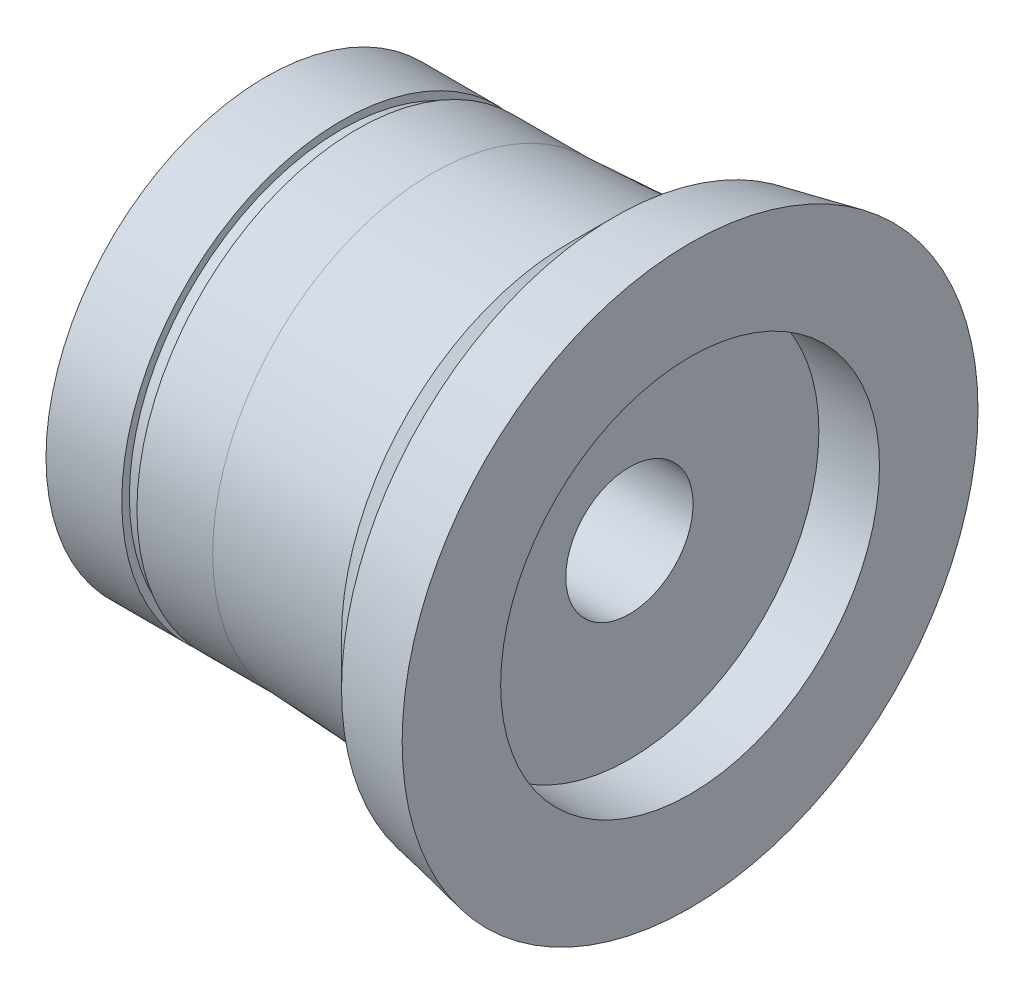
ISO-10303-21;
HEADER;
FILE_DESCRIPTION(('STEP AP214'),'2;1');
FILE_NAME('part.step','',(''),(''),'','','');
FILE_SCHEMA(('AUTOMOTIVE_DESIGN { 1 0 10303 214 1 1 1 1 }'));
ENDSEC;
DATA;
#1=APPLICATION_CONTEXT('core data for automotive mechanical design processes');
#2=APPLICATION_PROTOCOL_DEFINITION('international standard','automotive_design',2000,#1);
#3=PRODUCT_CONTEXT('',#1,'mechanical');
#4=PRODUCT('Part','Part','',(#3));
#5=PRODUCT_RELATED_PRODUCT_CATEGORY('part','',(#4));
#6=PRODUCT_DEFINITION_FORMATION('','',#4);
#7=PRODUCT_DEFINITION_CONTEXT('part definition',#1,'design');
#8=PRODUCT_DEFINITION('design','',#6,#7);
#9=PRODUCT_DEFINITION_SHAPE('','',#8);
#10=(LENGTH_UNIT() NAMED_UNIT(*) SI_UNIT(.MILLI.,.METRE.));
#11=(NAMED_UNIT(*) PLANE_ANGLE_UNIT() SI_UNIT($,.RADIAN.));
#12=(NAMED_UNIT(*) SI_UNIT($,.STERADIAN.) SOLID_ANGLE_UNIT());
#13=UNCERTAINTY_MEASURE_WITH_UNIT(LENGTH_MEASURE(1.E-05),#10,'distance_accuracy_value','');
#14=(GEOMETRIC_REPRESENTATION_CONTEXT(3) GLOBAL_UNCERTAINTY_ASSIGNED_CONTEXT((#13)) GLOBAL_UNIT_ASSIGNED_CONTEXT((#10,
#11,#12)) REPRESENTATION_CONTEXT('',''));
#15=CARTESIAN_POINT('',(0.,0.,0.));
#16=DIRECTION('',(0.,0.,1.));
#17=DIRECTION('',(1.,0.,0.));
#18=AXIS2_PLACEMENT_3D('',#15,#16,#17);
#19=CARTESIAN_POINT('',(0.,0.,0.));
#20=DIRECTION('',(1.,0.,0.));
#21=DIRECTION('',(0.,0.,-1.));
#22=AXIS2_PLACEMENT_3D('',#19,#20,#21);
#23=CONICAL_SURFACE('',#22,9.5,0.197395559849881);
#24=CARTESIAN_POINT('',(-2.5,0.,0.));
#25=DIRECTION('',(-1.,0.,0.));
#26=DIRECTION('',(0.,0.,1.));
#27=AXIS2_PLACEMENT_3D('',#24,#25,#26);
#28=CIRCLE('',#27,9.);
#29=CARTESIAN_POINT('',(-2.5,0.,9.));
#30=VERTEX_POINT('',#29);
#31=EDGE_CURVE('E73',#30,#30,#28,.T.);
#32=ORIENTED_EDGE('',*,*,#31,.F.);
#33=EDGE_LOOP('',(#32));
#34=FACE_BOUND('',#33,.T.);
#35=CARTESIAN_POINT('',(0.,0.,0.));
#36=DIRECTION('',(-1.,0.,0.));
#37=DIRECTION('',(0.,0.,1.));
#38=AXIS2_PLACEMENT_3D('',#35,#36,#37);
#39=CIRCLE('',#38,9.5);
#40=CARTESIAN_POINT('',(0.,0.,9.5));
#41=VERTEX_POINT('',#40);
#42=EDGE_CURVE('E10',#41,#41,#39,.T.);
#43=ORIENTED_EDGE('',*,*,#42,.T.);
#44=EDGE_LOOP('',(#43));
#45=FACE_BOUND('',#44,.T.);
#46=ADVANCED_FACE('F24',(#34,#45),#23,.T.);
#47=CARTESIAN_POINT('',(0.,9.5,0.));
#48=DIRECTION('',(-1.,0.,0.));
#49=DIRECTION('',(0.,0.,1.));
#50=AXIS2_PLACEMENT_3D('',#47,#48,#49);
#51=PLANE('',#50);
#52=ORIENTED_EDGE('',*,*,#42,.F.);
#53=EDGE_LOOP('',(#52));
#54=FACE_BOUND('',#53,.T.);
#55=CARTESIAN_POINT('',(0.,0.,0.));
#56=DIRECTION('',(-1.,0.,0.));
#57=DIRECTION('',(0.,0.,1.));
#58=AXIS2_PLACEMENT_3D('',#55,#56,#57);
#59=CIRCLE('',#58,6.25);
#60=CARTESIAN_POINT('',(0.,0.,6.25));
#61=VERTEX_POINT('',#60);
#62=EDGE_CURVE('E30',#61,#61,#59,.T.);
#63=ORIENTED_EDGE('',*,*,#62,.T.);
#64=EDGE_LOOP('',(#63));
#65=FACE_BOUND('',#64,.T.);
#66=ADVANCED_FACE('F80',(#54,#65),#51,.F.);
#67=CARTESIAN_POINT('',(-14.2531085040796,0.,0.));
#68=DIRECTION('',(-1.,0.,0.));
#69=DIRECTION('',(0.,0.,1.));
#70=AXIS2_PLACEMENT_3D('',#67,#68,#69);
#71=CYLINDRICAL_SURFACE('',#70,6.25);
#72=ORIENTED_EDGE('',*,*,#62,.F.);
#73=EDGE_LOOP('',(#72));
#74=FACE_BOUND('',#73,.T.);
#75=CARTESIAN_POINT('',(-2.,0.,0.));
#76=DIRECTION('',(-1.,0.,0.));
#77=DIRECTION('',(0.,0.,1.));
#78=AXIS2_PLACEMENT_3D('',#75,#76,#77);
#79=CIRCLE('',#78,6.25);
#80=CARTESIAN_POINT('',(-2.,0.,6.25));
#81=VERTEX_POINT('',#80);
#82=EDGE_CURVE('E34',#81,#81,#79,.T.);
#83=ORIENTED_EDGE('',*,*,#82,.T.);
#84=EDGE_LOOP('',(#83));
#85=FACE_BOUND('',#84,.T.);
#86=ADVANCED_FACE('F84',(#74,#85),#71,.F.);
#87=CARTESIAN_POINT('',(-2.,2.1,0.));
#88=DIRECTION('',(-1.,0.,0.));
#89=DIRECTION('',(0.,0.,1.));
#90=AXIS2_PLACEMENT_3D('',#87,#88,#89);
#91=PLANE('',#90);
#92=ORIENTED_EDGE('',*,*,#82,.F.);
#93=EDGE_LOOP('',(#92));
#94=FACE_BOUND('',#93,.T.);
#95=CARTESIAN_POINT('',(-2.,0.,0.));
#96=DIRECTION('',(-1.,0.,0.));
#97=DIRECTION('',(0.,0.,1.));
#98=AXIS2_PLACEMENT_3D('',#95,#96,#97);
#99=CIRCLE('',#98,2.1);
#100=CARTESIAN_POINT('',(-2.,0.,2.1));
#101=VERTEX_POINT('',#100);
#102=EDGE_CURVE('E38',#101,#101,#99,.T.);
#103=ORIENTED_EDGE('',*,*,#102,.T.);
#104=EDGE_LOOP('',(#103));
#105=FACE_BOUND('',#104,.T.);
#106=ADVANCED_FACE('F89',(#94,#105),#91,.F.);
#107=CARTESIAN_POINT('',(-14.2531085040796,0.,0.));
#108=DIRECTION('',(-1.,0.,0.));
#109=DIRECTION('',(0.,0.,1.));
#110=AXIS2_PLACEMENT_3D('',#107,#108,#109);
#111=CYLINDRICAL_SURFACE('',#110,2.1);
#112=ORIENTED_EDGE('',*,*,#102,.F.);
#113=EDGE_LOOP('',(#112));
#114=FACE_BOUND('',#113,.T.);
#115=CARTESIAN_POINT('',(-11.,0.,0.));
#116=DIRECTION('',(-1.,0.,0.));
#117=DIRECTION('',(0.,0.,1.));
#118=AXIS2_PLACEMENT_3D('',#115,#116,#117);
#119=CIRCLE('',#118,2.1);
#120=CARTESIAN_POINT('',(-11.,0.,2.1));
#121=VERTEX_POINT('',#120);
#122=EDGE_CURVE('E43',#121,#121,#119,.T.);
#123=ORIENTED_EDGE('',*,*,#122,.T.);
#124=EDGE_LOOP('',(#123));
#125=FACE_BOUND('',#124,.T.);
#126=ADVANCED_FACE('F95',(#114,#125),#111,.F.);
#127=CARTESIAN_POINT('',(-11.,5.,0.));
#128=DIRECTION('',(1.,0.,0.));
#129=DIRECTION('',(0.,0.,-1.));
#130=AXIS2_PLACEMENT_3D('',#127,#128,#129);
#131=PLANE('',#130);
#132=ORIENTED_EDGE('',*,*,#122,.F.);
#133=EDGE_LOOP('',(#132));
#134=FACE_BOUND('',#133,.T.);
#135=CARTESIAN_POINT('',(-11.,0.,0.));
#136=DIRECTION('',(-1.,0.,0.));
#137=DIRECTION('',(0.,0.,1.));
#138=AXIS2_PLACEMENT_3D('',#135,#136,#137);
#139=CIRCLE('',#138,5.);
#140=CARTESIAN_POINT('',(-11.,0.,5.));
#141=VERTEX_POINT('',#140);
#142=EDGE_CURVE('E46',#141,#141,#139,.T.);
#143=ORIENTED_EDGE('',*,*,#142,.T.);
#144=EDGE_LOOP('',(#143));
#145=FACE_BOUND('',#144,.T.);
#146=ADVANCED_FACE('F99',(#134,#145),#131,.F.);
#147=CARTESIAN_POINT('',(-14.2531085040796,0.,0.));
#148=DIRECTION('',(-1.,0.,0.));
#149=DIRECTION('',(0.,0.,1.));
#150=AXIS2_PLACEMENT_3D('',#147,#148,#149);
#151=CYLINDRICAL_SURFACE('',#150,5.);
#152=ORIENTED_EDGE('',*,*,#142,.F.);
#153=EDGE_LOOP('',(#152));
#154=FACE_BOUND('',#153,.T.);
#155=CARTESIAN_POINT('',(-14.,0.,0.));
#156=DIRECTION('',(-1.,0.,0.));
#157=DIRECTION('',(0.,0.,1.));
#158=AXIS2_PLACEMENT_3D('',#155,#156,#157);
#159=CIRCLE('',#158,5.);
#160=CARTESIAN_POINT('',(-14.,0.,5.));
#161=VERTEX_POINT('',#160);
#162=EDGE_CURVE('E49',#161,#161,#159,.T.);
#163=ORIENTED_EDGE('',*,*,#162,.T.);
#164=EDGE_LOOP('',(#163));
#165=FACE_BOUND('',#164,.T.);
#166=ADVANCED_FACE('F103',(#154,#165),#151,.F.);
#167=CARTESIAN_POINT('',(-14.,5.,0.));
#168=DIRECTION('',(1.,0.,0.));
#169=DIRECTION('',(0.,0.,-1.));
#170=AXIS2_PLACEMENT_3D('',#167,#168,#169);
#171=PLANE('',#170);
#172=ORIENTED_EDGE('',*,*,#162,.F.);
#173=EDGE_LOOP('',(#172));
#174=FACE_BOUND('',#173,.T.);
#175=CARTESIAN_POINT('',(-14.,0.,0.));
#176=DIRECTION('',(-1.,0.,0.));
#177=DIRECTION('',(0.,0.,1.));
#178=AXIS2_PLACEMENT_3D('',#175,#176,#177);
#179=CIRCLE('',#178,7.25);
#180=CARTESIAN_POINT('',(-14.,0.,7.25));
#181=VERTEX_POINT('',#180);
#182=EDGE_CURVE('E52',#181,#181,#179,.T.);
#183=ORIENTED_EDGE('',*,*,#182,.T.);
#184=EDGE_LOOP('',(#183));
#185=FACE_BOUND('',#184,.T.);
#186=ADVANCED_FACE('F107',(#174,#185),#171,.F.);
#187=CARTESIAN_POINT('',(-14.2531085040796,0.,0.));
#188=DIRECTION('',(-1.,0.,0.));
#189=DIRECTION('',(0.,0.,1.));
#190=AXIS2_PLACEMENT_3D('',#187,#188,#189);
#191=CYLINDRICAL_SURFACE('',#190,7.25);
#192=ORIENTED_EDGE('',*,*,#182,.F.);
#193=EDGE_LOOP('',(#192));
#194=FACE_BOUND('',#193,.T.);
#195=CARTESIAN_POINT('',(-11.5,0.,0.));
#196=DIRECTION('',(-1.,0.,0.));
#197=DIRECTION('',(0.,0.,1.));
#198=AXIS2_PLACEMENT_3D('',#195,#196,#197);
#199=CIRCLE('',#198,7.25);
#200=CARTESIAN_POINT('',(-11.5,0.,7.25));
#201=VERTEX_POINT('',#200);
#202=EDGE_CURVE('E55',#201,#201,#199,.T.);
#203=ORIENTED_EDGE('',*,*,#202,.T.);
#204=EDGE_LOOP('',(#203));
#205=FACE_BOUND('',#204,.T.);
#206=ADVANCED_FACE('F111',(#194,#205),#191,.T.);
#207=CARTESIAN_POINT('',(-11.5,7.25,0.));
#208=DIRECTION('',(-1.,0.,0.));
#209=DIRECTION('',(0.,0.,1.));
#210=AXIS2_PLACEMENT_3D('',#207,#208,#209);
#211=PLANE('',#210);
#212=ORIENTED_EDGE('',*,*,#202,.F.);
#213=EDGE_LOOP('',(#212));
#214=FACE_BOUND('',#213,.T.);
#215=CARTESIAN_POINT('',(-11.5,0.,0.));
#216=DIRECTION('',(-1.,0.,0.));
#217=DIRECTION('',(0.,0.,1.));
#218=AXIS2_PLACEMENT_3D('',#215,#216,#217);
#219=CIRCLE('',#218,7.);
#220=CARTESIAN_POINT('',(-11.5,0.,7.));
#221=VERTEX_POINT('',#220);
#222=EDGE_CURVE('E58',#221,#221,#219,.T.);
#223=ORIENTED_EDGE('',*,*,#222,.T.);
#224=EDGE_LOOP('',(#223));
#225=FACE_BOUND('',#224,.T.);
#226=ADVANCED_FACE('F115',(#214,#225),#211,.F.);
#227=CARTESIAN_POINT('',(-14.2531085040796,0.,0.));
#228=DIRECTION('',(-1.,0.,0.));
#229=DIRECTION('',(0.,0.,1.));
#230=AXIS2_PLACEMENT_3D('',#227,#228,#229);
#231=CYLINDRICAL_SURFACE('',#230,7.);
#232=ORIENTED_EDGE('',*,*,#222,.F.);
#233=EDGE_LOOP('',(#232));
#234=FACE_BOUND('',#233,.T.);
#235=CARTESIAN_POINT('',(-11.,0.,0.));
#236=DIRECTION('',(-1.,0.,0.));
#237=DIRECTION('',(0.,0.,1.));
#238=AXIS2_PLACEMENT_3D('',#235,#236,#237);
#239=CIRCLE('',#238,7.);
#240=CARTESIAN_POINT('',(-11.,0.,7.));
#241=VERTEX_POINT('',#240);
#242=EDGE_CURVE('E61',#241,#241,#239,.T.);
#243=ORIENTED_EDGE('',*,*,#242,.T.);
#244=EDGE_LOOP('',(#243));
#245=FACE_BOUND('',#244,.T.);
#246=ADVANCED_FACE('F119',(#234,#245),#231,.T.);
#247=CARTESIAN_POINT('',(-11.,7.,0.));
#248=DIRECTION('',(1.,0.,0.));
#249=DIRECTION('',(0.,0.,-1.));
#250=AXIS2_PLACEMENT_3D('',#247,#248,#249);
#251=PLANE('',#250);
#252=ORIENTED_EDGE('',*,*,#242,.F.);
#253=EDGE_LOOP('',(#252));
#254=FACE_BOUND('',#253,.T.);
#255=CARTESIAN_POINT('',(-11.,0.,0.));
#256=DIRECTION('',(-1.,0.,0.));
#257=DIRECTION('',(0.,0.,1.));
#258=AXIS2_PLACEMENT_3D('',#255,#256,#257);
#259=CIRCLE('',#258,7.25);
#260=CARTESIAN_POINT('',(-11.,0.,7.25));
#261=VERTEX_POINT('',#260);
#262=EDGE_CURVE('E64',#261,#261,#259,.T.);
#263=ORIENTED_EDGE('',*,*,#262,.T.);
#264=EDGE_LOOP('',(#263));
#265=FACE_BOUND('',#264,.T.);
#266=ADVANCED_FACE('F123',(#254,#265),#251,.F.);
#267=CARTESIAN_POINT('',(-14.2531085040796,0.,0.));
#268=DIRECTION('',(-1.,0.,0.));
#269=DIRECTION('',(0.,0.,1.));
#270=AXIS2_PLACEMENT_3D('',#267,#268,#269);
#271=CYLINDRICAL_SURFACE('',#270,7.25);
#272=ORIENTED_EDGE('',*,*,#262,.F.);
#273=EDGE_LOOP('',(#272));
#274=FACE_BOUND('',#273,.T.);
#275=CARTESIAN_POINT('',(-8.5,0.,0.));
#276=DIRECTION('',(-1.,0.,0.));
#277=DIRECTION('',(0.,0.,1.));
#278=AXIS2_PLACEMENT_3D('',#275,#276,#277);
#279=CIRCLE('',#278,7.25);
#280=CARTESIAN_POINT('',(-8.5,0.,7.25));
#281=VERTEX_POINT('',#280);
#282=EDGE_CURVE('E67',#281,#281,#279,.T.);
#283=ORIENTED_EDGE('',*,*,#282,.T.);
#284=EDGE_LOOP('',(#283));
#285=FACE_BOUND('',#284,.T.);
#286=ADVANCED_FACE('F127',(#274,#285),#271,.T.);
#287=CARTESIAN_POINT('',(-4.,0.,0.));
#288=DIRECTION('',(1.,0.,0.));
#289=DIRECTION('',(0.,0.,-1.));
#290=AXIS2_PLACEMENT_3D('',#287,#288,#289);
#291=CONICAL_SURFACE('',#290,7.5,0.0554985052457167);
#292=ORIENTED_EDGE('',*,*,#282,.F.);
#293=EDGE_LOOP('',(#292));
#294=FACE_BOUND('',#293,.T.);
#295=CARTESIAN_POINT('',(-4.,0.,0.));
#296=DIRECTION('',(-1.,0.,0.));
#297=DIRECTION('',(0.,0.,1.));
#298=AXIS2_PLACEMENT_3D('',#295,#296,#297);
#299=CIRCLE('',#298,7.5);
#300=CARTESIAN_POINT('',(-4.,0.,7.5));
#301=VERTEX_POINT('',#300);
#302=EDGE_CURVE('E70',#301,#301,#299,.T.);
#303=ORIENTED_EDGE('',*,*,#302,.T.);
#304=EDGE_LOOP('',(#303));
#305=FACE_BOUND('',#304,.T.);
#306=ADVANCED_FACE('F131',(#294,#305),#291,.T.);
#307=CARTESIAN_POINT('',(-2.5,0.,0.));
#308=DIRECTION('',(1.,0.,0.));
#309=DIRECTION('',(0.,0.,-1.));
#310=AXIS2_PLACEMENT_3D('',#307,#308,#309);
#311=CONICAL_SURFACE('',#310,9.,0.785398163397448);
#312=ORIENTED_EDGE('',*,*,#302,.F.);
#313=EDGE_LOOP('',(#312));
#314=FACE_BOUND('',#313,.T.);
#315=ORIENTED_EDGE('',*,*,#31,.T.);
#316=EDGE_LOOP('',(#315));
#317=FACE_BOUND('',#316,.T.);
#318=ADVANCED_FACE('F77',(#314,#317),#311,.T.);
#319=CLOSED_SHELL('',(#46,#66,#86,#106,#126,#146,#166,#186,#206,#226,#246,#266,#286,#306,#318));
#320=MANIFOLD_SOLID_BREP('B2',#319);
#321=ADVANCED_BREP_SHAPE_REPRESENTATION('',(#18,#320),#14);
#322=SHAPE_DEFINITION_REPRESENTATION(#9,#321);
ENDSEC;
END-ISO-10303-21;
